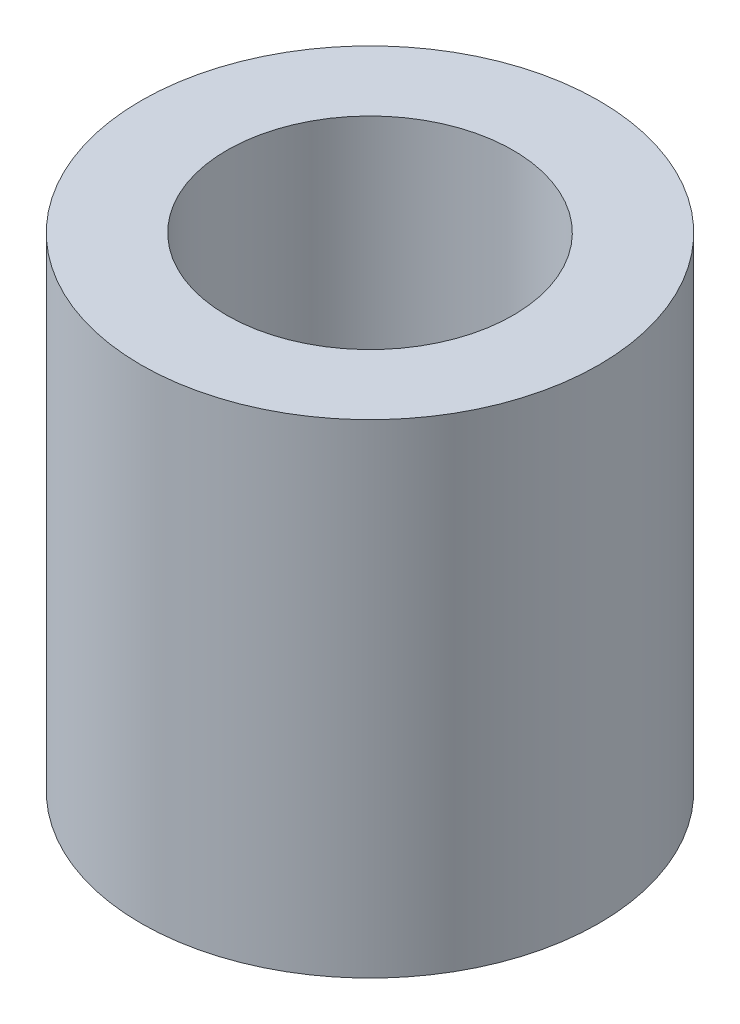
ISO-10303-21;
HEADER;
FILE_DESCRIPTION(('STEP AP214'),'2;1');
FILE_NAME('part.step','',(''),(''),'','','');
FILE_SCHEMA(('AUTOMOTIVE_DESIGN { 1 0 10303 214 1 1 1 1 }'));
ENDSEC;
DATA;
#1=APPLICATION_CONTEXT('core data for automotive mechanical design processes');
#2=APPLICATION_PROTOCOL_DEFINITION('international standard','automotive_design',2000,#1);
#3=PRODUCT_CONTEXT('',#1,'mechanical');
#4=PRODUCT('Part','Part','',(#3));
#5=PRODUCT_RELATED_PRODUCT_CATEGORY('part','',(#4));
#6=PRODUCT_DEFINITION_FORMATION('','',#4);
#7=PRODUCT_DEFINITION_CONTEXT('part definition',#1,'design');
#8=PRODUCT_DEFINITION('design','',#6,#7);
#9=PRODUCT_DEFINITION_SHAPE('','',#8);
#10=(LENGTH_UNIT() NAMED_UNIT(*) SI_UNIT(.MILLI.,.METRE.));
#11=(NAMED_UNIT(*) PLANE_ANGLE_UNIT() SI_UNIT($,.RADIAN.));
#12=(NAMED_UNIT(*) SI_UNIT($,.STERADIAN.) SOLID_ANGLE_UNIT());
#13=UNCERTAINTY_MEASURE_WITH_UNIT(LENGTH_MEASURE(1.E-05),#10,'distance_accuracy_value','');
#14=(GEOMETRIC_REPRESENTATION_CONTEXT(3) GLOBAL_UNCERTAINTY_ASSIGNED_CONTEXT((#13)) GLOBAL_UNIT_ASSIGNED_CONTEXT((#10,
#11,#12)) REPRESENTATION_CONTEXT('',''));
#15=CARTESIAN_POINT('',(0.,0.,0.));
#16=DIRECTION('',(0.,0.,1.));
#17=DIRECTION('',(1.,0.,0.));
#18=AXIS2_PLACEMENT_3D('',#15,#16,#17);
#19=CARTESIAN_POINT('',(0.,8.45,0.));
#20=DIRECTION('',(0.,1.,0.));
#21=DIRECTION('',(0.,0.,1.));
#22=AXIS2_PLACEMENT_3D('',#19,#20,#21);
#23=PLANE('',#22);
#24=CARTESIAN_POINT('',(0.,8.45,0.));
#25=DIRECTION('',(0.,1.,0.));
#26=DIRECTION('',(0.,0.,1.));
#27=AXIS2_PLACEMENT_3D('',#24,#25,#26);
#28=CIRCLE('',#27,4.);
#29=CARTESIAN_POINT('',(0.,8.45,4.));
#30=VERTEX_POINT('',#29);
#31=EDGE_CURVE('E10',#30,#30,#28,.T.);
#32=ORIENTED_EDGE('',*,*,#31,.T.);
#33=EDGE_LOOP('',(#32));
#34=FACE_BOUND('',#33,.T.);
#35=CARTESIAN_POINT('',(0.,8.45,0.));
#36=DIRECTION('',(0.,1.,0.));
#37=DIRECTION('',(0.,0.,1.));
#38=AXIS2_PLACEMENT_3D('',#35,#36,#37);
#39=CIRCLE('',#38,2.5);
#40=CARTESIAN_POINT('',(0.,8.45,2.5));
#41=VERTEX_POINT('',#40);
#42=EDGE_CURVE('E48',#41,#41,#39,.T.);
#43=ORIENTED_EDGE('',*,*,#42,.F.);
#44=EDGE_LOOP('',(#43));
#45=FACE_BOUND('',#44,.T.);
#46=ADVANCED_FACE('F37',(#34,#45),#23,.T.);
#47=CARTESIAN_POINT('',(0.,0.,0.));
#48=DIRECTION('',(0.,1.,0.));
#49=DIRECTION('',(0.,0.,1.));
#50=AXIS2_PLACEMENT_3D('',#47,#48,#49);
#51=PLANE('',#50);
#52=CARTESIAN_POINT('',(0.,0.,0.));
#53=DIRECTION('',(0.,1.,0.));
#54=DIRECTION('',(0.,0.,1.));
#55=AXIS2_PLACEMENT_3D('',#52,#53,#54);
#56=CIRCLE('',#55,4.);
#57=CARTESIAN_POINT('',(0.,0.,4.));
#58=VERTEX_POINT('',#57);
#59=EDGE_CURVE('E41',#58,#58,#56,.T.);
#60=ORIENTED_EDGE('',*,*,#59,.F.);
#61=EDGE_LOOP('',(#60));
#62=FACE_BOUND('',#61,.T.);
#63=CARTESIAN_POINT('',(0.,0.,0.));
#64=DIRECTION('',(0.,1.,0.));
#65=DIRECTION('',(0.,0.,1.));
#66=AXIS2_PLACEMENT_3D('',#63,#64,#65);
#67=CIRCLE('',#66,2.5);
#68=CARTESIAN_POINT('',(0.,0.,2.5));
#69=VERTEX_POINT('',#68);
#70=EDGE_CURVE('E50',#69,#69,#67,.T.);
#71=ORIENTED_EDGE('',*,*,#70,.T.);
#72=EDGE_LOOP('',(#71));
#73=FACE_BOUND('',#72,.T.);
#74=ADVANCED_FACE('F60',(#62,#73),#51,.F.);
#75=CARTESIAN_POINT('',(0.,8.45,0.));
#76=DIRECTION('',(0.,-1.,0.));
#77=DIRECTION('',(0.,0.,-1.));
#78=AXIS2_PLACEMENT_3D('',#75,#76,#77);
#79=CYLINDRICAL_SURFACE('',#78,4.);
#80=ORIENTED_EDGE('',*,*,#31,.F.);
#81=EDGE_LOOP('',(#80));
#82=FACE_BOUND('',#81,.T.);
#83=ORIENTED_EDGE('',*,*,#59,.T.);
#84=EDGE_LOOP('',(#83));
#85=FACE_BOUND('',#84,.T.);
#86=ADVANCED_FACE('F39',(#82,#85),#79,.T.);
#87=CARTESIAN_POINT('',(0.,8.45,0.));
#88=DIRECTION('',(0.,-1.,0.));
#89=DIRECTION('',(0.,0.,-1.));
#90=AXIS2_PLACEMENT_3D('',#87,#88,#89);
#91=CYLINDRICAL_SURFACE('',#90,2.5);
#92=ORIENTED_EDGE('',*,*,#42,.T.);
#93=EDGE_LOOP('',(#92));
#94=FACE_BOUND('',#93,.T.);
#95=ORIENTED_EDGE('',*,*,#70,.F.);
#96=EDGE_LOOP('',(#95));
#97=FACE_BOUND('',#96,.T.);
#98=ADVANCED_FACE('F56',(#94,#97),#91,.F.);
#99=CLOSED_SHELL('',(#46,#74,#86,#98));
#100=MANIFOLD_SOLID_BREP('B2',#99);
#101=ADVANCED_BREP_SHAPE_REPRESENTATION('',(#18,#100),#14);
#102=SHAPE_DEFINITION_REPRESENTATION(#9,#101);
ENDSEC;
END-ISO-10303-21;
